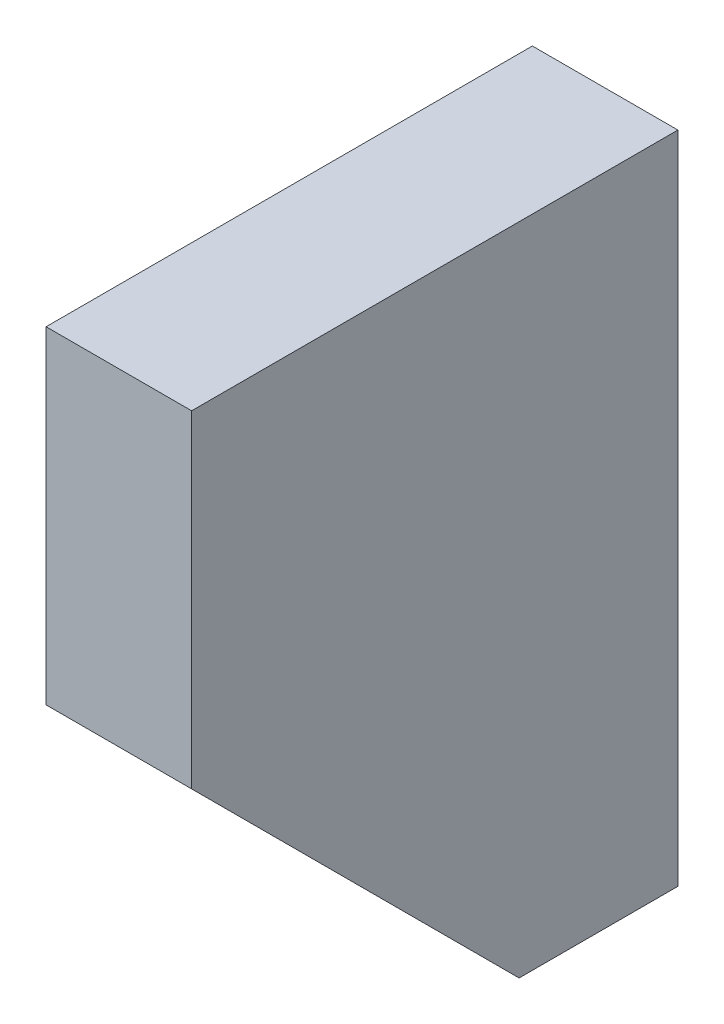
ISO-10303-21;
HEADER;
FILE_DESCRIPTION(('STEP AP214'),'2;1');
FILE_NAME('part.step','',(''),(''),'','','');
FILE_SCHEMA(('AUTOMOTIVE_DESIGN { 1 0 10303 214 1 1 1 1 }'));
ENDSEC;
DATA;
#1=APPLICATION_CONTEXT('core data for automotive mechanical design processes');
#2=APPLICATION_PROTOCOL_DEFINITION('international standard','automotive_design',2000,#1);
#3=PRODUCT_CONTEXT('',#1,'mechanical');
#4=PRODUCT('Part','Part','',(#3));
#5=PRODUCT_RELATED_PRODUCT_CATEGORY('part','',(#4));
#6=PRODUCT_DEFINITION_FORMATION('','',#4);
#7=PRODUCT_DEFINITION_CONTEXT('part definition',#1,'design');
#8=PRODUCT_DEFINITION('design','',#6,#7);
#9=PRODUCT_DEFINITION_SHAPE('','',#8);
#10=(LENGTH_UNIT() NAMED_UNIT(*) SI_UNIT(.MILLI.,.METRE.));
#11=(NAMED_UNIT(*) PLANE_ANGLE_UNIT() SI_UNIT($,.RADIAN.));
#12=(NAMED_UNIT(*) SI_UNIT($,.STERADIAN.) SOLID_ANGLE_UNIT());
#13=UNCERTAINTY_MEASURE_WITH_UNIT(LENGTH_MEASURE(1.E-05),#10,'distance_accuracy_value','');
#14=(GEOMETRIC_REPRESENTATION_CONTEXT(3) GLOBAL_UNCERTAINTY_ASSIGNED_CONTEXT((#13)) GLOBAL_UNIT_ASSIGNED_CONTEXT((#10,
#11,#12)) REPRESENTATION_CONTEXT('',''));
#15=CARTESIAN_POINT('',(0.,0.,0.));
#16=DIRECTION('',(0.,0.,1.));
#17=DIRECTION('',(1.,0.,0.));
#18=AXIS2_PLACEMENT_3D('',#15,#16,#17);
#19=CARTESIAN_POINT('',(0.,0.,73.5));
#20=DIRECTION('',(1.,0.,0.));
#21=DIRECTION('',(0.,0.,-1.));
#22=AXIS2_PLACEMENT_3D('',#19,#20,#21);
#23=PLANE('',#22);
#24=DIRECTION('',(0.,0.,-1.));
#25=VECTOR('',#24,1.);
#26=CARTESIAN_POINT('',(0.,0.,73.5));
#27=LINE('',#26,#25);
#28=CARTESIAN_POINT('',(0.,0.,24.));
#29=VERTEX_POINT('',#28);
#30=CARTESIAN_POINT('',(0.,0.,0.));
#31=VERTEX_POINT('',#30);
#32=EDGE_CURVE('E47',#29,#31,#27,.T.);
#33=ORIENTED_EDGE('',*,*,#32,.F.);
#34=DIRECTION('',(0.,-0.707106781186547,-0.707106781186547));
#35=VECTOR('',#34,1.);
#36=CARTESIAN_POINT('',(0.,0.,24.));
#37=LINE('',#36,#35);
#38=CARTESIAN_POINT('',(0.,49.5,73.5));
#39=VERTEX_POINT('',#38);
#40=EDGE_CURVE('E130',#39,#29,#37,.T.);
#41=ORIENTED_EDGE('',*,*,#40,.F.);
#42=DIRECTION('',(0.,-1.,0.));
#43=VECTOR('',#42,1.);
#44=CARTESIAN_POINT('',(0.,0.,73.5));
#45=LINE('',#44,#43);
#46=CARTESIAN_POINT('',(0.,99.,73.5));
#47=VERTEX_POINT('',#46);
#48=EDGE_CURVE('E92',#47,#39,#45,.T.);
#49=ORIENTED_EDGE('',*,*,#48,.F.);
#50=DIRECTION('',(0.,0.,-1.));
#51=VECTOR('',#50,1.);
#52=CARTESIAN_POINT('',(0.,99.,73.5));
#53=LINE('',#52,#51);
#54=CARTESIAN_POINT('',(0.,99.,0.));
#55=VERTEX_POINT('',#54);
#56=EDGE_CURVE('E84',#47,#55,#53,.T.);
#57=ORIENTED_EDGE('',*,*,#56,.T.);
#58=DIRECTION('',(0.,-1.,0.));
#59=VECTOR('',#58,1.);
#60=CARTESIAN_POINT('',(0.,0.,0.));
#61=LINE('',#60,#59);
#62=EDGE_CURVE('E98',#55,#31,#61,.T.);
#63=ORIENTED_EDGE('',*,*,#62,.T.);
#64=EDGE_LOOP('',(#33,#41,#49,#57,#63));
#65=FACE_BOUND('',#64,.T.);
#66=ADVANCED_FACE('F39',(#65),#23,.F.);
#67=CARTESIAN_POINT('',(0.,0.,73.5));
#68=DIRECTION('',(0.,1.,0.));
#69=DIRECTION('',(0.,0.,1.));
#70=AXIS2_PLACEMENT_3D('',#67,#68,#69);
#71=PLANE('',#70);
#72=DIRECTION('',(0.,0.,-1.));
#73=VECTOR('',#72,1.);
#74=CARTESIAN_POINT('',(22.,0.,73.5));
#75=LINE('',#74,#73);
#76=CARTESIAN_POINT('',(22.,0.,24.));
#77=VERTEX_POINT('',#76);
#78=CARTESIAN_POINT('',(22.,0.,0.));
#79=VERTEX_POINT('',#78);
#80=EDGE_CURVE('E120',#77,#79,#75,.T.);
#81=ORIENTED_EDGE('',*,*,#80,.F.);
#82=DIRECTION('',(-1.,0.,0.));
#83=VECTOR('',#82,1.);
#84=CARTESIAN_POINT('',(35.,0.,24.));
#85=LINE('',#84,#83);
#86=EDGE_CURVE('E111',#77,#29,#85,.T.);
#87=ORIENTED_EDGE('',*,*,#86,.T.);
#88=ORIENTED_EDGE('',*,*,#32,.T.);
#89=DIRECTION('',(1.,0.,0.));
#90=VECTOR('',#89,1.);
#91=CARTESIAN_POINT('',(0.,0.,0.));
#92=LINE('',#91,#90);
#93=EDGE_CURVE('E105',#31,#79,#92,.T.);
#94=ORIENTED_EDGE('',*,*,#93,.T.);
#95=EDGE_LOOP('',(#81,#87,#88,#94));
#96=FACE_BOUND('',#95,.T.);
#97=ADVANCED_FACE('F126',(#96),#71,.F.);
#98=CARTESIAN_POINT('',(22.,0.,73.5));
#99=DIRECTION('',(-1.,0.,0.));
#100=DIRECTION('',(0.,0.,1.));
#101=AXIS2_PLACEMENT_3D('',#98,#99,#100);
#102=PLANE('',#101);
#103=DIRECTION('',(0.,1.,0.));
#104=VECTOR('',#103,1.);
#105=CARTESIAN_POINT('',(22.,0.,73.5));
#106=LINE('',#105,#104);
#107=CARTESIAN_POINT('',(22.,49.5,73.5));
#108=VERTEX_POINT('',#107);
#109=CARTESIAN_POINT('',(22.,99.,73.5));
#110=VERTEX_POINT('',#109);
#111=EDGE_CURVE('E136',#108,#110,#106,.T.);
#112=ORIENTED_EDGE('',*,*,#111,.F.);
#113=DIRECTION('',(0.,-0.707106781186548,-0.707106781186548));
#114=VECTOR('',#113,1.);
#115=CARTESIAN_POINT('',(22.,24.75,48.75));
#116=LINE('',#115,#114);
#117=EDGE_CURVE('E54',#108,#77,#116,.T.);
#118=ORIENTED_EDGE('',*,*,#117,.T.);
#119=ORIENTED_EDGE('',*,*,#80,.T.);
#120=DIRECTION('',(0.,1.,0.));
#121=VECTOR('',#120,1.);
#122=CARTESIAN_POINT('',(22.,0.,0.));
#123=LINE('',#122,#121);
#124=CARTESIAN_POINT('',(22.,99.,0.));
#125=VERTEX_POINT('',#124);
#126=EDGE_CURVE('E93',#79,#125,#123,.T.);
#127=ORIENTED_EDGE('',*,*,#126,.T.);
#128=DIRECTION('',(0.,0.,-1.));
#129=VECTOR('',#128,1.);
#130=CARTESIAN_POINT('',(22.,99.,73.5));
#131=LINE('',#130,#129);
#132=EDGE_CURVE('E87',#110,#125,#131,.T.);
#133=ORIENTED_EDGE('',*,*,#132,.F.);
#134=EDGE_LOOP('',(#112,#118,#119,#127,#133));
#135=FACE_BOUND('',#134,.T.);
#136=ADVANCED_FACE('F138',(#135),#102,.F.);
#137=CARTESIAN_POINT('',(0.,99.,73.5));
#138=DIRECTION('',(0.,-1.,0.));
#139=DIRECTION('',(0.,0.,-1.));
#140=AXIS2_PLACEMENT_3D('',#137,#138,#139);
#141=PLANE('',#140);
#142=DIRECTION('',(-1.,0.,0.));
#143=VECTOR('',#142,1.);
#144=CARTESIAN_POINT('',(0.,99.,0.));
#145=LINE('',#144,#143);
#146=EDGE_CURVE('E81',#125,#55,#145,.T.);
#147=ORIENTED_EDGE('',*,*,#146,.T.);
#148=ORIENTED_EDGE('',*,*,#56,.F.);
#149=DIRECTION('',(-1.,0.,0.));
#150=VECTOR('',#149,1.);
#151=CARTESIAN_POINT('',(0.,99.,73.5));
#152=LINE('',#151,#150);
#153=EDGE_CURVE('E62',#110,#47,#152,.T.);
#154=ORIENTED_EDGE('',*,*,#153,.F.);
#155=ORIENTED_EDGE('',*,*,#132,.T.);
#156=EDGE_LOOP('',(#147,#148,#154,#155));
#157=FACE_BOUND('',#156,.T.);
#158=ADVANCED_FACE('F83',(#157),#141,.F.);
#159=CARTESIAN_POINT('',(0.,0.,73.5));
#160=DIRECTION('',(0.,0.,-1.));
#161=DIRECTION('',(-1.,0.,0.));
#162=AXIS2_PLACEMENT_3D('',#159,#160,#161);
#163=PLANE('',#162);
#164=ORIENTED_EDGE('',*,*,#48,.T.);
#165=DIRECTION('',(1.,0.,0.));
#166=VECTOR('',#165,1.);
#167=CARTESIAN_POINT('',(0.,49.5,73.5));
#168=LINE('',#167,#166);
#169=EDGE_CURVE('E11',#39,#108,#168,.T.);
#170=ORIENTED_EDGE('',*,*,#169,.T.);
#171=ORIENTED_EDGE('',*,*,#111,.T.);
#172=ORIENTED_EDGE('',*,*,#153,.T.);
#173=EDGE_LOOP('',(#164,#170,#171,#172));
#174=FACE_BOUND('',#173,.T.);
#175=ADVANCED_FACE('F135',(#174),#163,.F.);
#176=CARTESIAN_POINT('',(0.,0.,0.));
#177=DIRECTION('',(0.,0.,-1.));
#178=DIRECTION('',(-1.,0.,0.));
#179=AXIS2_PLACEMENT_3D('',#176,#177,#178);
#180=PLANE('',#179);
#181=ORIENTED_EDGE('',*,*,#62,.F.);
#182=ORIENTED_EDGE('',*,*,#146,.F.);
#183=ORIENTED_EDGE('',*,*,#126,.F.);
#184=ORIENTED_EDGE('',*,*,#93,.F.);
#185=EDGE_LOOP('',(#181,#182,#183,#184));
#186=FACE_BOUND('',#185,.T.);
#187=ADVANCED_FACE('F103',(#186),#180,.T.);
#188=CARTESIAN_POINT('',(35.,0.,24.));
#189=DIRECTION('',(0.,0.707106781186548,-0.707106781186548));
#190=DIRECTION('',(0.,0.707106781186548,0.707106781186548));
#191=AXIS2_PLACEMENT_3D('',#188,#189,#190);
#192=PLANE('',#191);
#193=ORIENTED_EDGE('',*,*,#169,.F.);
#194=ORIENTED_EDGE('',*,*,#40,.T.);
#195=ORIENTED_EDGE('',*,*,#86,.F.);
#196=ORIENTED_EDGE('',*,*,#117,.F.);
#197=EDGE_LOOP('',(#193,#194,#195,#196));
#198=FACE_BOUND('',#197,.T.);
#199=ADVANCED_FACE('F133',(#198),#192,.F.);
#200=CLOSED_SHELL('',(#66,#97,#136,#158,#175,#187,#199));
#201=MANIFOLD_SOLID_BREP('B2',#200);
#202=ADVANCED_BREP_SHAPE_REPRESENTATION('',(#18,#201),#14);
#203=SHAPE_DEFINITION_REPRESENTATION(#9,#202);
ENDSEC;
END-ISO-10303-21;
